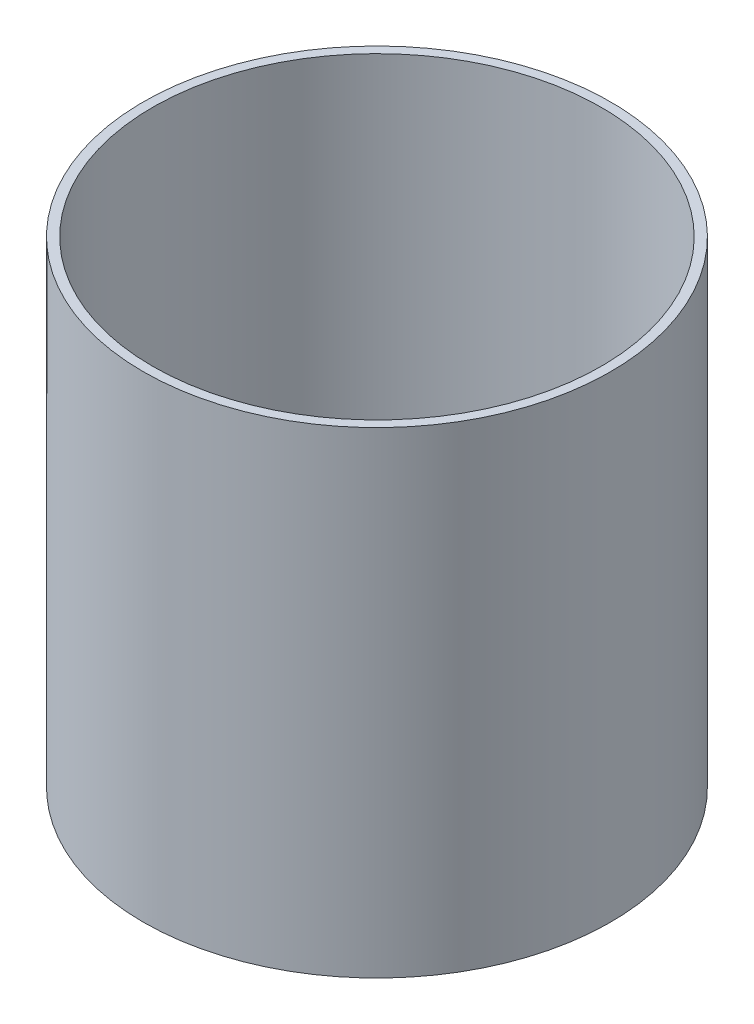
ISO-10303-21;
HEADER;
FILE_DESCRIPTION(('STEP AP214'),'2;1');
FILE_NAME('part.step','',(''),(''),'','','');
FILE_SCHEMA(('AUTOMOTIVE_DESIGN { 1 0 10303 214 1 1 1 1 }'));
ENDSEC;
DATA;
#1=APPLICATION_CONTEXT('core data for automotive mechanical design processes');
#2=APPLICATION_PROTOCOL_DEFINITION('international standard','automotive_design',2000,#1);
#3=PRODUCT_CONTEXT('',#1,'mechanical');
#4=PRODUCT('Part','Part','',(#3));
#5=PRODUCT_RELATED_PRODUCT_CATEGORY('part','',(#4));
#6=PRODUCT_DEFINITION_FORMATION('','',#4);
#7=PRODUCT_DEFINITION_CONTEXT('part definition',#1,'design');
#8=PRODUCT_DEFINITION('design','',#6,#7);
#9=PRODUCT_DEFINITION_SHAPE('','',#8);
#10=(LENGTH_UNIT() NAMED_UNIT(*) SI_UNIT(.MILLI.,.METRE.));
#11=(NAMED_UNIT(*) PLANE_ANGLE_UNIT() SI_UNIT($,.RADIAN.));
#12=(NAMED_UNIT(*) SI_UNIT($,.STERADIAN.) SOLID_ANGLE_UNIT());
#13=UNCERTAINTY_MEASURE_WITH_UNIT(LENGTH_MEASURE(1.E-05),#10,'distance_accuracy_value','');
#14=(GEOMETRIC_REPRESENTATION_CONTEXT(3) GLOBAL_UNCERTAINTY_ASSIGNED_CONTEXT((#13)) GLOBAL_UNIT_ASSIGNED_CONTEXT((#10,
#11,#12)) REPRESENTATION_CONTEXT('',''));
#15=CARTESIAN_POINT('',(0.,0.,0.));
#16=DIRECTION('',(0.,0.,1.));
#17=DIRECTION('',(1.,0.,0.));
#18=AXIS2_PLACEMENT_3D('',#15,#16,#17);
#19=CARTESIAN_POINT('',(0.,2.,0.));
#20=DIRECTION('',(0.,1.,0.));
#21=DIRECTION('',(0.,0.,1.));
#22=AXIS2_PLACEMENT_3D('',#19,#20,#21);
#23=PLANE('',#22);
#24=CARTESIAN_POINT('',(0.23886771472674,2.,32.0082737733824));
#25=DIRECTION('',(0.,1.,0.));
#26=DIRECTION('',(0.,0.,1.));
#27=AXIS2_PLACEMENT_3D('',#24,#25,#26);
#28=CIRCLE('',#27,1.44999999999999);
#29=CARTESIAN_POINT('',(1.68693137880172,2.,31.9333629945469));
#30=VERTEX_POINT('',#29);
#31=CARTESIAN_POINT('',(-1.17896407502397,2.,31.7045419575114));
#32=VERTEX_POINT('',#31);
#33=EDGE_CURVE('E63',#30,#32,#28,.T.);
#34=ORIENTED_EDGE('',*,*,#33,.F.);
#35=CARTESIAN_POINT('',(0.,2.,35.));
#36=DIRECTION('',(0.,1.,0.));
#37=DIRECTION('',(0.,0.,1.));
#38=AXIS2_PLACEMENT_3D('',#35,#36,#37);
#39=CIRCLE('',#38,3.5);
#40=EDGE_CURVE('E73',#32,#30,#39,.T.);
#41=ORIENTED_EDGE('',*,*,#40,.F.);
#42=EDGE_LOOP('',(#34,#41));
#43=FACE_BOUND('',#42,.T.);
#44=CARTESIAN_POINT('',(-32.7248769175622,2.,-0.318490286301964));
#45=DIRECTION('',(0.,1.,0.));
#46=DIRECTION('',(0.,0.,1.));
#47=AXIS2_PLACEMENT_3D('',#44,#45,#46);
#48=CIRCLE('',#47,1.45);
#49=CARTESIAN_POINT('',(-32.7248769175622,2.,1.13150971369804));
#50=VERTEX_POINT('',#49);
#51=EDGE_CURVE('E74',#50,#50,#48,.T.);
#52=ORIENTED_EDGE('',*,*,#51,.F.);
#53=EDGE_LOOP('',(#52));
#54=FACE_BOUND('',#53,.T.);
#55=CARTESIAN_POINT('',(-0.238867714726726,2.,-32.9637446322886));
#56=DIRECTION('',(0.,1.,0.));
#57=DIRECTION('',(0.,0.,1.));
#58=AXIS2_PLACEMENT_3D('',#55,#56,#57);
#59=CIRCLE('',#58,1.44999999999999);
#60=CARTESIAN_POINT('',(-0.238867714726726,2.,-31.5137446322886));
#61=VERTEX_POINT('',#60);
#62=EDGE_CURVE('E282',#61,#61,#59,.T.);
#63=ORIENTED_EDGE('',*,*,#62,.F.);
#64=EDGE_LOOP('',(#63));
#65=FACE_BOUND('',#64,.T.);
#66=CARTESIAN_POINT('',(31.7694060586553,2.,-0.159245143150811));
#67=DIRECTION('',(0.,1.,0.));
#68=DIRECTION('',(0.,0.,1.));
#69=AXIS2_PLACEMENT_3D('',#66,#67,#68);
#70=CIRCLE('',#69,1.45);
#71=CARTESIAN_POINT('',(31.7694060586553,2.,1.29075485684919));
#72=VERTEX_POINT('',#71);
#73=EDGE_CURVE('E284',#72,#72,#70,.T.);
#74=ORIENTED_EDGE('',*,*,#73,.F.);
#75=EDGE_LOOP('',(#74));
#76=FACE_BOUND('',#75,.T.);
#77=CARTESIAN_POINT('',(0.,2.,0.));
#78=DIRECTION('',(0.,1.,0.));
#79=DIRECTION('',(0.,0.,1.));
#80=AXIS2_PLACEMENT_3D('',#77,#78,#79);
#81=CIRCLE('',#80,2.);
#82=CARTESIAN_POINT('',(0.,2.,2.));
#83=VERTEX_POINT('',#82);
#84=EDGE_CURVE('E79',#83,#83,#81,.T.);
#85=ORIENTED_EDGE('',*,*,#84,.F.);
#86=EDGE_LOOP('',(#85));
#87=FACE_BOUND('',#86,.T.);
#88=CARTESIAN_POINT('',(7.5,2.,0.));
#89=DIRECTION('',(0.,1.,0.));
#90=DIRECTION('',(0.,0.,1.));
#91=AXIS2_PLACEMENT_3D('',#88,#89,#90);
#92=CIRCLE('',#91,2.);
#93=CARTESIAN_POINT('',(7.5,2.,2.));
#94=VERTEX_POINT('',#93);
#95=EDGE_CURVE('E97',#94,#94,#92,.T.);
#96=ORIENTED_EDGE('',*,*,#95,.F.);
#97=EDGE_LOOP('',(#96));
#98=FACE_BOUND('',#97,.T.);
#99=CARTESIAN_POINT('',(-7.5,2.,0.));
#100=DIRECTION('',(0.,1.,0.));
#101=DIRECTION('',(0.,0.,1.));
#102=AXIS2_PLACEMENT_3D('',#99,#100,#101);
#103=CIRCLE('',#102,2.);
#104=CARTESIAN_POINT('',(-7.5,2.,2.));
#105=VERTEX_POINT('',#104);
#106=EDGE_CURVE('E98',#105,#105,#103,.T.);
#107=ORIENTED_EDGE('',*,*,#106,.F.);
#108=EDGE_LOOP('',(#107));
#109=FACE_BOUND('',#108,.T.);
#110=CARTESIAN_POINT('',(0.,2.,0.));
#111=DIRECTION('',(0.,1.,0.));
#112=DIRECTION('',(0.,0.,1.));
#113=AXIS2_PLACEMENT_3D('',#110,#111,#112);
#114=CIRCLE('',#113,48.);
#115=CARTESIAN_POINT('',(0.,2.,48.));
#116=VERTEX_POINT('',#115);
#117=EDGE_CURVE('E68',#116,#116,#114,.F.);
#118=ORIENTED_EDGE('',*,*,#117,.F.);
#119=EDGE_LOOP('',(#118));
#120=FACE_BOUND('',#119,.T.);
#121=ADVANCED_FACE('F37',(#43,#54,#65,#76,#87,#98,#109,#120),#23,.T.);
#122=CARTESIAN_POINT('',(0.,2.,0.));
#123=DIRECTION('',(0.,-1.,0.));
#124=DIRECTION('',(0.,0.,-1.));
#125=AXIS2_PLACEMENT_3D('',#122,#123,#124);
#126=CYLINDRICAL_SURFACE('',#125,50.);
#127=CARTESIAN_POINT('',(0.,0.,0.));
#128=DIRECTION('',(0.,1.,0.));
#129=DIRECTION('',(0.,0.,1.));
#130=AXIS2_PLACEMENT_3D('',#127,#128,#129);
#131=CIRCLE('',#130,50.);
#132=CARTESIAN_POINT('',(0.,0.,50.));
#133=VERTEX_POINT('',#132);
#134=EDGE_CURVE('E105',#133,#133,#131,.T.);
#135=ORIENTED_EDGE('',*,*,#134,.T.);
#136=EDGE_LOOP('',(#135));
#137=FACE_BOUND('',#136,.T.);
#138=CARTESIAN_POINT('',(0.,102.,0.));
#139=DIRECTION('',(0.,1.,0.));
#140=DIRECTION('',(0.,0.,1.));
#141=AXIS2_PLACEMENT_3D('',#138,#139,#140);
#142=CIRCLE('',#141,50.);
#143=CARTESIAN_POINT('',(0.,102.,50.));
#144=VERTEX_POINT('',#143);
#145=EDGE_CURVE('E94',#144,#144,#142,.T.);
#146=ORIENTED_EDGE('',*,*,#145,.F.);
#147=EDGE_LOOP('',(#146));
#148=FACE_BOUND('',#147,.T.);
#149=ADVANCED_FACE('F39',(#137,#148),#126,.T.);
#150=CARTESIAN_POINT('',(0.,0.,0.));
#151=DIRECTION('',(0.,1.,0.));
#152=DIRECTION('',(0.,0.,1.));
#153=AXIS2_PLACEMENT_3D('',#150,#151,#152);
#154=PLANE('',#153);
#155=CARTESIAN_POINT('',(-32.7248769175622,0.,-0.318490286301964));
#156=DIRECTION('',(0.,1.,0.));
#157=DIRECTION('',(0.,0.,1.));
#158=AXIS2_PLACEMENT_3D('',#155,#156,#157);
#159=CIRCLE('',#158,1.45);
#160=CARTESIAN_POINT('',(-32.7248769175622,0.,1.13150971369804));
#161=VERTEX_POINT('',#160);
#162=EDGE_CURVE('E41',#161,#161,#159,.T.);
#163=ORIENTED_EDGE('',*,*,#162,.T.);
#164=EDGE_LOOP('',(#163));
#165=FACE_BOUND('',#164,.T.);
#166=CARTESIAN_POINT('',(-0.238867714726726,0.,-32.9637446322886));
#167=DIRECTION('',(0.,1.,0.));
#168=DIRECTION('',(0.,0.,1.));
#169=AXIS2_PLACEMENT_3D('',#166,#167,#168);
#170=CIRCLE('',#169,1.44999999999999);
#171=CARTESIAN_POINT('',(-0.238867714726726,0.,-31.5137446322886));
#172=VERTEX_POINT('',#171);
#173=EDGE_CURVE('E82',#172,#172,#170,.T.);
#174=ORIENTED_EDGE('',*,*,#173,.T.);
#175=EDGE_LOOP('',(#174));
#176=FACE_BOUND('',#175,.T.);
#177=CARTESIAN_POINT('',(31.7694060586553,0.,-0.159245143150811));
#178=DIRECTION('',(0.,1.,0.));
#179=DIRECTION('',(0.,0.,1.));
#180=AXIS2_PLACEMENT_3D('',#177,#178,#179);
#181=CIRCLE('',#180,1.45);
#182=CARTESIAN_POINT('',(31.7694060586553,0.,1.29075485684919));
#183=VERTEX_POINT('',#182);
#184=EDGE_CURVE('E114',#183,#183,#181,.T.);
#185=ORIENTED_EDGE('',*,*,#184,.T.);
#186=EDGE_LOOP('',(#185));
#187=FACE_BOUND('',#186,.T.);
#188=CARTESIAN_POINT('',(0.,0.,35.));
#189=DIRECTION('',(0.,1.,0.));
#190=DIRECTION('',(0.,0.,1.));
#191=AXIS2_PLACEMENT_3D('',#188,#189,#190);
#192=CIRCLE('',#191,3.5);
#193=CARTESIAN_POINT('',(-1.17896407502397,0.,31.7045419575114));
#194=VERTEX_POINT('',#193);
#195=CARTESIAN_POINT('',(1.68693137880172,0.,31.9333629945469));
#196=VERTEX_POINT('',#195);
#197=EDGE_CURVE('E77',#194,#196,#192,.T.);
#198=ORIENTED_EDGE('',*,*,#197,.T.);
#199=CARTESIAN_POINT('',(0.23886771472674,0.,32.0082737733824));
#200=DIRECTION('',(0.,1.,0.));
#201=DIRECTION('',(0.,0.,1.));
#202=AXIS2_PLACEMENT_3D('',#199,#200,#201);
#203=CIRCLE('',#202,1.44999999999999);
#204=EDGE_CURVE('E54',#196,#194,#203,.T.);
#205=ORIENTED_EDGE('',*,*,#204,.T.);
#206=EDGE_LOOP('',(#198,#205));
#207=FACE_BOUND('',#206,.T.);
#208=CARTESIAN_POINT('',(-7.5,0.,0.));
#209=DIRECTION('',(0.,1.,0.));
#210=DIRECTION('',(0.,0.,1.));
#211=AXIS2_PLACEMENT_3D('',#208,#209,#210);
#212=CIRCLE('',#211,2.);
#213=CARTESIAN_POINT('',(-7.5,0.,2.));
#214=VERTEX_POINT('',#213);
#215=EDGE_CURVE('E101',#214,#214,#212,.F.);
#216=ORIENTED_EDGE('',*,*,#215,.F.);
#217=EDGE_LOOP('',(#216));
#218=FACE_BOUND('',#217,.T.);
#219=CARTESIAN_POINT('',(7.5,0.,0.));
#220=DIRECTION('',(0.,1.,0.));
#221=DIRECTION('',(0.,0.,1.));
#222=AXIS2_PLACEMENT_3D('',#219,#220,#221);
#223=CIRCLE('',#222,2.);
#224=CARTESIAN_POINT('',(7.5,0.,2.));
#225=VERTEX_POINT('',#224);
#226=EDGE_CURVE('E102',#225,#225,#223,.F.);
#227=ORIENTED_EDGE('',*,*,#226,.F.);
#228=EDGE_LOOP('',(#227));
#229=FACE_BOUND('',#228,.T.);
#230=ORIENTED_EDGE('',*,*,#134,.F.);
#231=EDGE_LOOP('',(#230));
#232=FACE_BOUND('',#231,.T.);
#233=ADVANCED_FACE('F119',(#165,#176,#187,#207,#218,#229,#232),#154,.F.);
#234=CARTESIAN_POINT('',(7.5,-5.65685424949238,0.));
#235=DIRECTION('',(0.,1.,0.));
#236=DIRECTION('',(0.,0.,1.));
#237=AXIS2_PLACEMENT_3D('',#234,#235,#236);
#238=CYLINDRICAL_SURFACE('',#237,2.);
#239=ORIENTED_EDGE('',*,*,#226,.T.);
#240=EDGE_LOOP('',(#239));
#241=FACE_BOUND('',#240,.T.);
#242=ORIENTED_EDGE('',*,*,#95,.T.);
#243=EDGE_LOOP('',(#242));
#244=FACE_BOUND('',#243,.T.);
#245=ADVANCED_FACE('F146',(#241,#244),#238,.F.);
#246=CARTESIAN_POINT('',(-7.5,-5.65685424949238,0.));
#247=DIRECTION('',(0.,1.,0.));
#248=DIRECTION('',(0.,0.,1.));
#249=AXIS2_PLACEMENT_3D('',#246,#247,#248);
#250=CYLINDRICAL_SURFACE('',#249,2.);
#251=ORIENTED_EDGE('',*,*,#215,.T.);
#252=EDGE_LOOP('',(#251));
#253=FACE_BOUND('',#252,.T.);
#254=ORIENTED_EDGE('',*,*,#106,.T.);
#255=EDGE_LOOP('',(#254));
#256=FACE_BOUND('',#255,.T.);
#257=ADVANCED_FACE('F153',(#253,#256),#250,.F.);
#258=CARTESIAN_POINT('',(0.,102.,0.));
#259=DIRECTION('',(0.,1.,0.));
#260=DIRECTION('',(0.,0.,1.));
#261=AXIS2_PLACEMENT_3D('',#258,#259,#260);
#262=PLANE('',#261);
#263=ORIENTED_EDGE('',*,*,#145,.T.);
#264=EDGE_LOOP('',(#263));
#265=FACE_BOUND('',#264,.T.);
#266=CARTESIAN_POINT('',(0.,102.,0.));
#267=DIRECTION('',(0.,1.,0.));
#268=DIRECTION('',(0.,0.,1.));
#269=AXIS2_PLACEMENT_3D('',#266,#267,#268);
#270=CIRCLE('',#269,48.);
#271=CARTESIAN_POINT('',(0.,102.,48.));
#272=VERTEX_POINT('',#271);
#273=EDGE_CURVE('E89',#272,#272,#270,.T.);
#274=ORIENTED_EDGE('',*,*,#273,.F.);
#275=EDGE_LOOP('',(#274));
#276=FACE_BOUND('',#275,.T.);
#277=ADVANCED_FACE('F160',(#265,#276),#262,.T.);
#278=CARTESIAN_POINT('',(0.,102.,0.));
#279=DIRECTION('',(0.,-1.,0.));
#280=DIRECTION('',(0.,0.,-1.));
#281=AXIS2_PLACEMENT_3D('',#278,#279,#280);
#282=CYLINDRICAL_SURFACE('',#281,48.);
#283=ORIENTED_EDGE('',*,*,#273,.T.);
#284=EDGE_LOOP('',(#283));
#285=FACE_BOUND('',#284,.T.);
#286=ORIENTED_EDGE('',*,*,#117,.T.);
#287=EDGE_LOOP('',(#286));
#288=FACE_BOUND('',#287,.T.);
#289=ADVANCED_FACE('F171',(#285,#288),#282,.F.);
#290=CARTESIAN_POINT('',(0.,22.,0.));
#291=DIRECTION('',(0.,-1.,0.));
#292=DIRECTION('',(0.,0.,-1.));
#293=AXIS2_PLACEMENT_3D('',#290,#291,#292);
#294=CYLINDRICAL_SURFACE('',#293,2.);
#295=CARTESIAN_POINT('',(0.,22.,0.));
#296=DIRECTION('',(0.,1.,0.));
#297=DIRECTION('',(0.,0.,1.));
#298=AXIS2_PLACEMENT_3D('',#295,#296,#297);
#299=CIRCLE('',#298,2.);
#300=CARTESIAN_POINT('',(0.,22.,2.));
#301=VERTEX_POINT('',#300);
#302=EDGE_CURVE('E86',#301,#301,#299,.T.);
#303=ORIENTED_EDGE('',*,*,#302,.F.);
#304=EDGE_LOOP('',(#303));
#305=FACE_BOUND('',#304,.T.);
#306=ORIENTED_EDGE('',*,*,#84,.T.);
#307=EDGE_LOOP('',(#306));
#308=FACE_BOUND('',#307,.T.);
#309=ADVANCED_FACE('F173',(#305,#308),#294,.T.);
#310=CARTESIAN_POINT('',(0.,22.,0.));
#311=DIRECTION('',(0.,1.,0.));
#312=DIRECTION('',(0.,0.,1.));
#313=AXIS2_PLACEMENT_3D('',#310,#311,#312);
#314=PLANE('',#313);
#315=ORIENTED_EDGE('',*,*,#302,.T.);
#316=EDGE_LOOP('',(#315));
#317=FACE_BOUND('',#316,.T.);
#318=ADVANCED_FACE('F180',(#317),#314,.T.);
#319=CARTESIAN_POINT('',(0.,-3.,35.));
#320=DIRECTION('',(0.,1.,0.));
#321=DIRECTION('',(0.,0.,1.));
#322=AXIS2_PLACEMENT_3D('',#319,#320,#321);
#323=CYLINDRICAL_SURFACE('',#322,3.5);
#324=ORIENTED_EDGE('',*,*,#197,.F.);
#325=DIRECTION('',(0.,1.,0.));
#326=VECTOR('',#325,1.);
#327=CARTESIAN_POINT('',(-1.17896407502397,-3.,31.7045419575114));
#328=LINE('',#327,#326);
#329=EDGE_CURVE('E11',#194,#32,#328,.T.);
#330=ORIENTED_EDGE('',*,*,#329,.T.);
#331=ORIENTED_EDGE('',*,*,#40,.T.);
#332=DIRECTION('',(0.,1.,0.));
#333=VECTOR('',#332,1.);
#334=CARTESIAN_POINT('',(1.68693137880172,-3.,31.9333629945469));
#335=LINE('',#334,#333);
#336=EDGE_CURVE('E46',#30,#196,#335,.F.);
#337=ORIENTED_EDGE('',*,*,#336,.T.);
#338=EDGE_LOOP('',(#324,#330,#331,#337));
#339=FACE_BOUND('',#338,.T.);
#340=ADVANCED_FACE('F76',(#339),#323,.F.);
#341=CARTESIAN_POINT('',(0.23886771472674,-8.,32.0082737733824));
#342=DIRECTION('',(0.,1.,0.));
#343=DIRECTION('',(0.,0.,1.));
#344=AXIS2_PLACEMENT_3D('',#341,#342,#343);
#345=CYLINDRICAL_SURFACE('',#344,1.44999999999999);
#346=ORIENTED_EDGE('',*,*,#204,.F.);
#347=ORIENTED_EDGE('',*,*,#336,.F.);
#348=ORIENTED_EDGE('',*,*,#33,.T.);
#349=ORIENTED_EDGE('',*,*,#329,.F.);
#350=EDGE_LOOP('',(#346,#347,#348,#349));
#351=FACE_BOUND('',#350,.T.);
#352=ADVANCED_FACE('F62',(#351),#345,.F.);
#353=CARTESIAN_POINT('',(31.7694060586553,-8.,-0.159245143150811));
#354=DIRECTION('',(0.,1.,0.));
#355=DIRECTION('',(0.,0.,1.));
#356=AXIS2_PLACEMENT_3D('',#353,#354,#355);
#357=CYLINDRICAL_SURFACE('',#356,1.45);
#358=ORIENTED_EDGE('',*,*,#73,.T.);
#359=EDGE_LOOP('',(#358));
#360=FACE_BOUND('',#359,.T.);
#361=ORIENTED_EDGE('',*,*,#184,.F.);
#362=EDGE_LOOP('',(#361));
#363=FACE_BOUND('',#362,.T.);
#364=ADVANCED_FACE('F125',(#360,#363),#357,.F.);
#365=CARTESIAN_POINT('',(-0.238867714726726,-8.,-32.9637446322886));
#366=DIRECTION('',(0.,1.,0.));
#367=DIRECTION('',(0.,0.,1.));
#368=AXIS2_PLACEMENT_3D('',#365,#366,#367);
#369=CYLINDRICAL_SURFACE('',#368,1.44999999999999);
#370=ORIENTED_EDGE('',*,*,#62,.T.);
#371=EDGE_LOOP('',(#370));
#372=FACE_BOUND('',#371,.T.);
#373=ORIENTED_EDGE('',*,*,#173,.F.);
#374=EDGE_LOOP('',(#373));
#375=FACE_BOUND('',#374,.T.);
#376=ADVANCED_FACE('F122',(#372,#375),#369,.F.);
#377=CARTESIAN_POINT('',(-32.7248769175622,-8.,-0.318490286301964));
#378=DIRECTION('',(0.,1.,0.));
#379=DIRECTION('',(0.,0.,1.));
#380=AXIS2_PLACEMENT_3D('',#377,#378,#379);
#381=CYLINDRICAL_SURFACE('',#380,1.45);
#382=ORIENTED_EDGE('',*,*,#51,.T.);
#383=EDGE_LOOP('',(#382));
#384=FACE_BOUND('',#383,.T.);
#385=ORIENTED_EDGE('',*,*,#162,.F.);
#386=EDGE_LOOP('',(#385));
#387=FACE_BOUND('',#386,.T.);
#388=ADVANCED_FACE('F124',(#384,#387),#381,.F.);
#389=CLOSED_SHELL('',(#121,#149,#233,#245,#257,#277,#289,#309,#318,#340,#352,#364,#376,#388));
#390=MANIFOLD_SOLID_BREP('B2',#389);
#391=ADVANCED_BREP_SHAPE_REPRESENTATION('',(#18,#390),#14);
#392=SHAPE_DEFINITION_REPRESENTATION(#9,#391);
ENDSEC;
END-ISO-10303-21;
